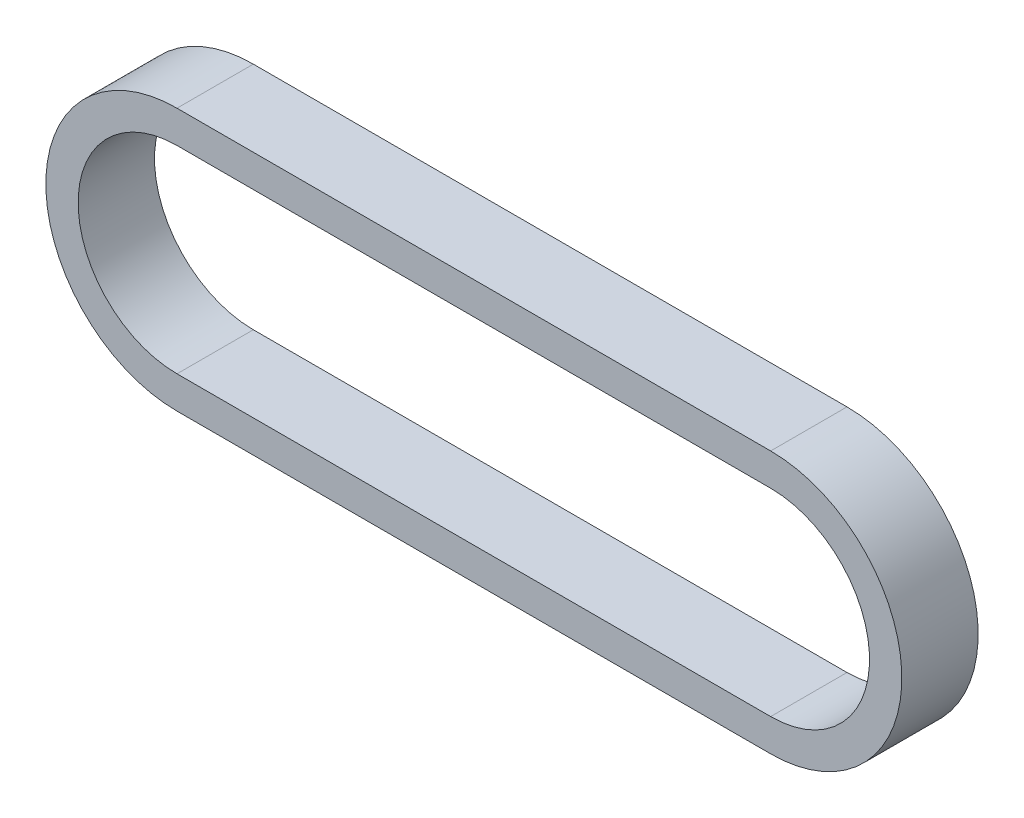
ISO-10303-21;
HEADER;
FILE_DESCRIPTION(('STEP AP214'),'2;1');
FILE_NAME('part.step','',(''),(''),'','','');
FILE_SCHEMA(('AUTOMOTIVE_DESIGN { 1 0 10303 214 1 1 1 1 }'));
ENDSEC;
DATA;
#1=APPLICATION_CONTEXT('core data for automotive mechanical design processes');
#2=APPLICATION_PROTOCOL_DEFINITION('international standard','automotive_design',2000,#1);
#3=PRODUCT_CONTEXT('',#1,'mechanical');
#4=PRODUCT('Part','Part','',(#3));
#5=PRODUCT_RELATED_PRODUCT_CATEGORY('part','',(#4));
#6=PRODUCT_DEFINITION_FORMATION('','',#4);
#7=PRODUCT_DEFINITION_CONTEXT('part definition',#1,'design');
#8=PRODUCT_DEFINITION('design','',#6,#7);
#9=PRODUCT_DEFINITION_SHAPE('','',#8);
#10=(LENGTH_UNIT() NAMED_UNIT(*) SI_UNIT(.MILLI.,.METRE.));
#11=(NAMED_UNIT(*) PLANE_ANGLE_UNIT() SI_UNIT($,.RADIAN.));
#12=(NAMED_UNIT(*) SI_UNIT($,.STERADIAN.) SOLID_ANGLE_UNIT());
#13=UNCERTAINTY_MEASURE_WITH_UNIT(LENGTH_MEASURE(1.E-05),#10,'distance_accuracy_value','');
#14=(GEOMETRIC_REPRESENTATION_CONTEXT(3) GLOBAL_UNCERTAINTY_ASSIGNED_CONTEXT((#13)) GLOBAL_UNIT_ASSIGNED_CONTEXT((#10,
#11,#12)) REPRESENTATION_CONTEXT('',''));
#15=CARTESIAN_POINT('',(0.,0.,0.));
#16=DIRECTION('',(0.,0.,1.));
#17=DIRECTION('',(1.,0.,0.));
#18=AXIS2_PLACEMENT_3D('',#15,#16,#17);
#19=CARTESIAN_POINT('',(0.,0.,4.5));
#20=DIRECTION('',(0.,0.,1.));
#21=DIRECTION('',(1.,0.,0.));
#22=AXIS2_PLACEMENT_3D('',#19,#20,#21);
#23=PLANE('',#22);
#24=CARTESIAN_POINT('',(0.,0.,4.5));
#25=DIRECTION('',(0.,0.,1.));
#26=DIRECTION('',(1.,0.,0.));
#27=AXIS2_PLACEMENT_3D('',#24,#25,#26);
#28=CIRCLE('',#27,15.4669567079091);
#29=CARTESIAN_POINT('',(0.,15.4669567079091,4.5));
#30=VERTEX_POINT('',#29);
#31=CARTESIAN_POINT('',(0.,-15.4669567079091,4.5));
#32=VERTEX_POINT('',#31);
#33=EDGE_CURVE('E157',#30,#32,#28,.T.);
#34=ORIENTED_EDGE('',*,*,#33,.T.);
#35=DIRECTION('',(1.,0.,0.));
#36=VECTOR('',#35,1.);
#37=CARTESIAN_POINT('',(0.,-15.4669567079091,4.5));
#38=LINE('',#37,#36);
#39=CARTESIAN_POINT('',(69.999999954,-15.4669567079091,4.5));
#40=VERTEX_POINT('',#39);
#41=EDGE_CURVE('E160',#32,#40,#38,.T.);
#42=ORIENTED_EDGE('',*,*,#41,.T.);
#43=CARTESIAN_POINT('',(69.999999954,0.,4.5));
#44=DIRECTION('',(0.,0.,1.));
#45=DIRECTION('',(1.,0.,0.));
#46=AXIS2_PLACEMENT_3D('',#43,#44,#45);
#47=CIRCLE('',#46,15.4669567079091);
#48=CARTESIAN_POINT('',(69.999999954,15.4669567079091,4.5));
#49=VERTEX_POINT('',#48);
#50=EDGE_CURVE('E163',#40,#49,#47,.T.);
#51=ORIENTED_EDGE('',*,*,#50,.T.);
#52=DIRECTION('',(-1.,0.,0.));
#53=VECTOR('',#52,1.);
#54=CARTESIAN_POINT('',(0.,15.4669567079091,4.5));
#55=LINE('',#54,#53);
#56=EDGE_CURVE('E165',#49,#30,#55,.T.);
#57=ORIENTED_EDGE('',*,*,#56,.T.);
#58=EDGE_LOOP('',(#34,#42,#51,#57));
#59=FACE_BOUND('',#58,.T.);
#60=DIRECTION('',(1.,0.,0.));
#61=VECTOR('',#60,1.);
#62=CARTESIAN_POINT('',(0.,-11.6569567079091,4.5));
#63=LINE('',#62,#61);
#64=CARTESIAN_POINT('',(0.,-11.6569567079091,4.5));
#65=VERTEX_POINT('',#64);
#66=CARTESIAN_POINT('',(69.999999954,-11.656956707909,4.5));
#67=VERTEX_POINT('',#66);
#68=EDGE_CURVE('E129',#65,#67,#63,.T.);
#69=ORIENTED_EDGE('',*,*,#68,.F.);
#70=CARTESIAN_POINT('',(0.,0.,4.5));
#71=DIRECTION('',(0.,0.,1.));
#72=DIRECTION('',(1.,0.,0.));
#73=AXIS2_PLACEMENT_3D('',#70,#71,#72);
#74=CIRCLE('',#73,11.6569567079091);
#75=CARTESIAN_POINT('',(0.,11.6569567079091,4.5));
#76=VERTEX_POINT('',#75);
#77=EDGE_CURVE('E121',#76,#65,#74,.T.);
#78=ORIENTED_EDGE('',*,*,#77,.F.);
#79=DIRECTION('',(-1.,0.,0.));
#80=VECTOR('',#79,1.);
#81=CARTESIAN_POINT('',(0.,11.6569567079091,4.5));
#82=LINE('',#81,#80);
#83=CARTESIAN_POINT('',(69.999999954,11.656956707909,4.5));
#84=VERTEX_POINT('',#83);
#85=EDGE_CURVE('E143',#84,#76,#82,.T.);
#86=ORIENTED_EDGE('',*,*,#85,.F.);
#87=CARTESIAN_POINT('',(69.999999954,0.,4.5));
#88=DIRECTION('',(0.,0.,1.));
#89=DIRECTION('',(1.,0.,0.));
#90=AXIS2_PLACEMENT_3D('',#87,#88,#89);
#91=CIRCLE('',#90,11.656956707909);
#92=EDGE_CURVE('E141',#67,#84,#91,.T.);
#93=ORIENTED_EDGE('',*,*,#92,.F.);
#94=EDGE_LOOP('',(#69,#78,#86,#93));
#95=FACE_BOUND('',#94,.T.);
#96=ADVANCED_FACE('F56',(#59,#95),#23,.T.);
#97=CARTESIAN_POINT('',(0.,0.,-4.5));
#98=DIRECTION('',(0.,0.,1.));
#99=DIRECTION('',(1.,0.,0.));
#100=AXIS2_PLACEMENT_3D('',#97,#98,#99);
#101=PLANE('',#100);
#102=CARTESIAN_POINT('',(0.,0.,-4.5));
#103=DIRECTION('',(0.,0.,1.));
#104=DIRECTION('',(1.,0.,0.));
#105=AXIS2_PLACEMENT_3D('',#102,#103,#104);
#106=CIRCLE('',#105,15.4669567079091);
#107=CARTESIAN_POINT('',(0.,15.4669567079091,-4.5));
#108=VERTEX_POINT('',#107);
#109=CARTESIAN_POINT('',(0.,-15.4669567079091,-4.5));
#110=VERTEX_POINT('',#109);
#111=EDGE_CURVE('E137',#108,#110,#106,.T.);
#112=ORIENTED_EDGE('',*,*,#111,.F.);
#113=DIRECTION('',(-1.,0.,0.));
#114=VECTOR('',#113,1.);
#115=CARTESIAN_POINT('',(0.,15.4669567079091,-4.5));
#116=LINE('',#115,#114);
#117=CARTESIAN_POINT('',(69.999999954,15.4669567079091,-4.5));
#118=VERTEX_POINT('',#117);
#119=EDGE_CURVE('E161',#118,#108,#116,.T.);
#120=ORIENTED_EDGE('',*,*,#119,.F.);
#121=CARTESIAN_POINT('',(69.999999954,0.,-4.5));
#122=DIRECTION('',(0.,0.,1.));
#123=DIRECTION('',(1.,0.,0.));
#124=AXIS2_PLACEMENT_3D('',#121,#122,#123);
#125=CIRCLE('',#124,15.4669567079091);
#126=CARTESIAN_POINT('',(69.999999954,-15.4669567079091,-4.5));
#127=VERTEX_POINT('',#126);
#128=EDGE_CURVE('E172',#127,#118,#125,.T.);
#129=ORIENTED_EDGE('',*,*,#128,.F.);
#130=DIRECTION('',(1.,0.,0.));
#131=VECTOR('',#130,1.);
#132=CARTESIAN_POINT('',(0.,-15.4669567079091,-4.5));
#133=LINE('',#132,#131);
#134=EDGE_CURVE('E170',#110,#127,#133,.T.);
#135=ORIENTED_EDGE('',*,*,#134,.F.);
#136=EDGE_LOOP('',(#112,#120,#129,#135));
#137=FACE_BOUND('',#136,.T.);
#138=CARTESIAN_POINT('',(0.,0.,-4.5));
#139=DIRECTION('',(0.,0.,1.));
#140=DIRECTION('',(1.,0.,0.));
#141=AXIS2_PLACEMENT_3D('',#138,#139,#140);
#142=CIRCLE('',#141,11.6569567079091);
#143=CARTESIAN_POINT('',(0.,11.6569567079091,-4.5));
#144=VERTEX_POINT('',#143);
#145=CARTESIAN_POINT('',(0.,-11.6569567079091,-4.5));
#146=VERTEX_POINT('',#145);
#147=EDGE_CURVE('E79',#144,#146,#142,.T.);
#148=ORIENTED_EDGE('',*,*,#147,.T.);
#149=DIRECTION('',(1.,0.,0.));
#150=VECTOR('',#149,1.);
#151=CARTESIAN_POINT('',(0.,-11.6569567079091,-4.5));
#152=LINE('',#151,#150);
#153=CARTESIAN_POINT('',(69.999999954,-11.656956707909,-4.5));
#154=VERTEX_POINT('',#153);
#155=EDGE_CURVE('E136',#146,#154,#152,.T.);
#156=ORIENTED_EDGE('',*,*,#155,.T.);
#157=CARTESIAN_POINT('',(69.999999954,0.,-4.5));
#158=DIRECTION('',(0.,0.,1.));
#159=DIRECTION('',(1.,0.,0.));
#160=AXIS2_PLACEMENT_3D('',#157,#158,#159);
#161=CIRCLE('',#160,11.656956707909);
#162=CARTESIAN_POINT('',(69.999999954,11.656956707909,-4.5));
#163=VERTEX_POINT('',#162);
#164=EDGE_CURVE('E149',#154,#163,#161,.T.);
#165=ORIENTED_EDGE('',*,*,#164,.T.);
#166=DIRECTION('',(-1.,0.,0.));
#167=VECTOR('',#166,1.);
#168=CARTESIAN_POINT('',(0.,11.6569567079091,-4.5));
#169=LINE('',#168,#167);
#170=EDGE_CURVE('E130',#163,#144,#169,.T.);
#171=ORIENTED_EDGE('',*,*,#170,.T.);
#172=EDGE_LOOP('',(#148,#156,#165,#171));
#173=FACE_BOUND('',#172,.T.);
#174=ADVANCED_FACE('F190',(#137,#173),#101,.F.);
#175=CARTESIAN_POINT('',(0.,0.,4.5));
#176=DIRECTION('',(0.,0.,-1.));
#177=DIRECTION('',(-1.,0.,0.));
#178=AXIS2_PLACEMENT_3D('',#175,#176,#177);
#179=CYLINDRICAL_SURFACE('',#178,15.4669567079091);
#180=ORIENTED_EDGE('',*,*,#111,.T.);
#181=DIRECTION('',(0.,0.,-1.));
#182=VECTOR('',#181,1.);
#183=CARTESIAN_POINT('',(0.,-15.4669567079091,4.5));
#184=LINE('',#183,#182);
#185=EDGE_CURVE('E12',#32,#110,#184,.T.);
#186=ORIENTED_EDGE('',*,*,#185,.F.);
#187=ORIENTED_EDGE('',*,*,#33,.F.);
#188=DIRECTION('',(0.,0.,-1.));
#189=VECTOR('',#188,1.);
#190=CARTESIAN_POINT('',(0.,15.4669567079091,4.5));
#191=LINE('',#190,#189);
#192=EDGE_CURVE('E167',#30,#108,#191,.T.);
#193=ORIENTED_EDGE('',*,*,#192,.T.);
#194=EDGE_LOOP('',(#180,#186,#187,#193));
#195=FACE_BOUND('',#194,.T.);
#196=ADVANCED_FACE('F58',(#195),#179,.T.);
#197=CARTESIAN_POINT('',(0.,-15.4669567079091,4.5));
#198=DIRECTION('',(0.,1.,0.));
#199=DIRECTION('',(-1.,0.,0.));
#200=AXIS2_PLACEMENT_3D('',#197,#198,#199);
#201=PLANE('',#200);
#202=ORIENTED_EDGE('',*,*,#134,.T.);
#203=DIRECTION('',(0.,0.,-1.));
#204=VECTOR('',#203,1.);
#205=CARTESIAN_POINT('',(69.999999954,-15.4669567079091,4.5));
#206=LINE('',#205,#204);
#207=EDGE_CURVE('E64',#40,#127,#206,.T.);
#208=ORIENTED_EDGE('',*,*,#207,.F.);
#209=ORIENTED_EDGE('',*,*,#41,.F.);
#210=ORIENTED_EDGE('',*,*,#185,.T.);
#211=EDGE_LOOP('',(#202,#208,#209,#210));
#212=FACE_BOUND('',#211,.T.);
#213=ADVANCED_FACE('F200',(#212),#201,.F.);
#214=CARTESIAN_POINT('',(69.999999954,0.,4.5));
#215=DIRECTION('',(0.,0.,-1.));
#216=DIRECTION('',(-1.,0.,0.));
#217=AXIS2_PLACEMENT_3D('',#214,#215,#216);
#218=CYLINDRICAL_SURFACE('',#217,15.4669567079091);
#219=ORIENTED_EDGE('',*,*,#128,.T.);
#220=DIRECTION('',(0.,0.,-1.));
#221=VECTOR('',#220,1.);
#222=CARTESIAN_POINT('',(69.999999954,15.4669567079091,4.5));
#223=LINE('',#222,#221);
#224=EDGE_CURVE('E177',#49,#118,#223,.T.);
#225=ORIENTED_EDGE('',*,*,#224,.F.);
#226=ORIENTED_EDGE('',*,*,#50,.F.);
#227=ORIENTED_EDGE('',*,*,#207,.T.);
#228=EDGE_LOOP('',(#219,#225,#226,#227));
#229=FACE_BOUND('',#228,.T.);
#230=ADVANCED_FACE('F184',(#229),#218,.T.);
#231=CARTESIAN_POINT('',(0.,15.4669567079091,4.5));
#232=DIRECTION('',(0.,-1.,0.));
#233=DIRECTION('',(1.,0.,0.));
#234=AXIS2_PLACEMENT_3D('',#231,#232,#233);
#235=PLANE('',#234);
#236=ORIENTED_EDGE('',*,*,#119,.T.);
#237=ORIENTED_EDGE('',*,*,#192,.F.);
#238=ORIENTED_EDGE('',*,*,#56,.F.);
#239=ORIENTED_EDGE('',*,*,#224,.T.);
#240=EDGE_LOOP('',(#236,#237,#238,#239));
#241=FACE_BOUND('',#240,.T.);
#242=ADVANCED_FACE('F194',(#241),#235,.F.);
#243=CARTESIAN_POINT('',(0.,0.,4.5));
#244=DIRECTION('',(0.,0.,-1.));
#245=DIRECTION('',(-1.,0.,0.));
#246=AXIS2_PLACEMENT_3D('',#243,#244,#245);
#247=CYLINDRICAL_SURFACE('',#246,11.6569567079091);
#248=ORIENTED_EDGE('',*,*,#147,.F.);
#249=DIRECTION('',(0.,0.,-1.));
#250=VECTOR('',#249,1.);
#251=CARTESIAN_POINT('',(0.,11.6569567079091,4.5));
#252=LINE('',#251,#250);
#253=EDGE_CURVE('E125',#76,#144,#252,.T.);
#254=ORIENTED_EDGE('',*,*,#253,.F.);
#255=ORIENTED_EDGE('',*,*,#77,.T.);
#256=DIRECTION('',(0.,0.,-1.));
#257=VECTOR('',#256,1.);
#258=CARTESIAN_POINT('',(0.,-11.6569567079091,4.5));
#259=LINE('',#258,#257);
#260=EDGE_CURVE('E124',#65,#146,#259,.T.);
#261=ORIENTED_EDGE('',*,*,#260,.T.);
#262=EDGE_LOOP('',(#248,#254,#255,#261));
#263=FACE_BOUND('',#262,.T.);
#264=ADVANCED_FACE('F123',(#263),#247,.F.);
#265=CARTESIAN_POINT('',(0.,-11.6569567079091,4.5));
#266=DIRECTION('',(0.,1.,0.));
#267=DIRECTION('',(-1.,0.,0.));
#268=AXIS2_PLACEMENT_3D('',#265,#266,#267);
#269=PLANE('',#268);
#270=ORIENTED_EDGE('',*,*,#155,.F.);
#271=ORIENTED_EDGE('',*,*,#260,.F.);
#272=ORIENTED_EDGE('',*,*,#68,.T.);
#273=DIRECTION('',(0.,0.,-1.));
#274=VECTOR('',#273,1.);
#275=CARTESIAN_POINT('',(69.999999954,-11.656956707909,4.5));
#276=LINE('',#275,#274);
#277=EDGE_CURVE('E138',#67,#154,#276,.T.);
#278=ORIENTED_EDGE('',*,*,#277,.T.);
#279=EDGE_LOOP('',(#270,#271,#272,#278));
#280=FACE_BOUND('',#279,.T.);
#281=ADVANCED_FACE('F133',(#280),#269,.T.);
#282=CARTESIAN_POINT('',(69.999999954,0.,4.5));
#283=DIRECTION('',(0.,0.,-1.));
#284=DIRECTION('',(-1.,0.,0.));
#285=AXIS2_PLACEMENT_3D('',#282,#283,#284);
#286=CYLINDRICAL_SURFACE('',#285,11.656956707909);
#287=ORIENTED_EDGE('',*,*,#164,.F.);
#288=ORIENTED_EDGE('',*,*,#277,.F.);
#289=ORIENTED_EDGE('',*,*,#92,.T.);
#290=DIRECTION('',(0.,0.,-1.));
#291=VECTOR('',#290,1.);
#292=CARTESIAN_POINT('',(69.999999954,11.656956707909,4.5));
#293=LINE('',#292,#291);
#294=EDGE_CURVE('E71',#84,#163,#293,.T.);
#295=ORIENTED_EDGE('',*,*,#294,.T.);
#296=EDGE_LOOP('',(#287,#288,#289,#295));
#297=FACE_BOUND('',#296,.T.);
#298=ADVANCED_FACE('F223',(#297),#286,.F.);
#299=CARTESIAN_POINT('',(0.,11.6569567079091,4.5));
#300=DIRECTION('',(0.,-1.,0.));
#301=DIRECTION('',(1.,0.,0.));
#302=AXIS2_PLACEMENT_3D('',#299,#300,#301);
#303=PLANE('',#302);
#304=ORIENTED_EDGE('',*,*,#170,.F.);
#305=ORIENTED_EDGE('',*,*,#294,.F.);
#306=ORIENTED_EDGE('',*,*,#85,.T.);
#307=ORIENTED_EDGE('',*,*,#253,.T.);
#308=EDGE_LOOP('',(#304,#305,#306,#307));
#309=FACE_BOUND('',#308,.T.);
#310=ADVANCED_FACE('F227',(#309),#303,.T.);
#311=CLOSED_SHELL('',(#96,#174,#196,#213,#230,#242,#264,#281,#298,#310));
#312=MANIFOLD_SOLID_BREP('B2',#311);
#313=ADVANCED_BREP_SHAPE_REPRESENTATION('',(#18,#312),#14);
#314=SHAPE_DEFINITION_REPRESENTATION(#9,#313);
ENDSEC;
END-ISO-10303-21;
